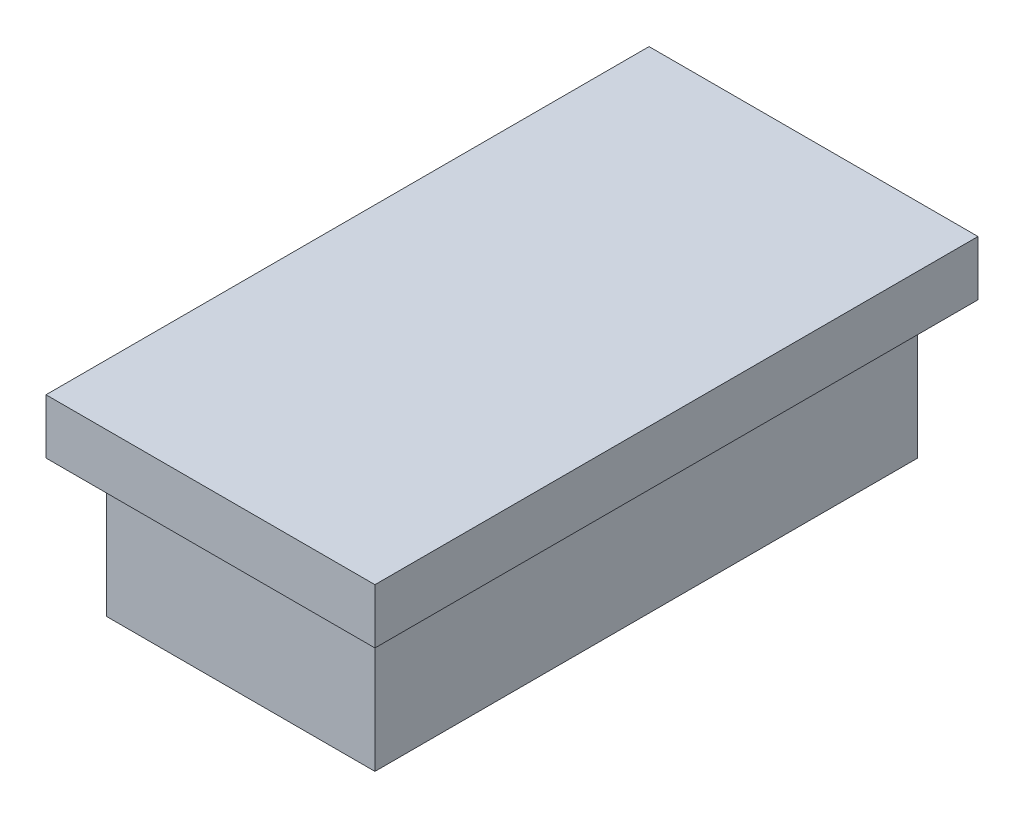
ISO-10303-21;
HEADER;
FILE_DESCRIPTION(('STEP AP214'),'2;1');
FILE_NAME('part.step','',(''),(''),'','','');
FILE_SCHEMA(('AUTOMOTIVE_DESIGN { 1 0 10303 214 1 1 1 1 }'));
ENDSEC;
DATA;
#1=APPLICATION_CONTEXT('core data for automotive mechanical design processes');
#2=APPLICATION_PROTOCOL_DEFINITION('international standard','automotive_design',2000,#1);
#3=PRODUCT_CONTEXT('',#1,'mechanical');
#4=PRODUCT('Part','Part','',(#3));
#5=PRODUCT_RELATED_PRODUCT_CATEGORY('part','',(#4));
#6=PRODUCT_DEFINITION_FORMATION('','',#4);
#7=PRODUCT_DEFINITION_CONTEXT('part definition',#1,'design');
#8=PRODUCT_DEFINITION('design','',#6,#7);
#9=PRODUCT_DEFINITION_SHAPE('','',#8);
#10=(LENGTH_UNIT() NAMED_UNIT(*) SI_UNIT(.MILLI.,.METRE.));
#11=(NAMED_UNIT(*) PLANE_ANGLE_UNIT() SI_UNIT($,.RADIAN.));
#12=(NAMED_UNIT(*) SI_UNIT($,.STERADIAN.) SOLID_ANGLE_UNIT());
#13=UNCERTAINTY_MEASURE_WITH_UNIT(LENGTH_MEASURE(1.E-05),#10,'distance_accuracy_value','');
#14=(GEOMETRIC_REPRESENTATION_CONTEXT(3) GLOBAL_UNCERTAINTY_ASSIGNED_CONTEXT((#13)) GLOBAL_UNIT_ASSIGNED_CONTEXT((#10,
#11,#12)) REPRESENTATION_CONTEXT('',''));
#15=CARTESIAN_POINT('',(0.,0.,0.));
#16=DIRECTION('',(0.,0.,1.));
#17=DIRECTION('',(1.,0.,0.));
#18=AXIS2_PLACEMENT_3D('',#15,#16,#17);
#19=CARTESIAN_POINT('',(-4.9,5.,9.9));
#20=DIRECTION('',(1.,0.,0.));
#21=DIRECTION('',(0.,0.,-1.));
#22=AXIS2_PLACEMENT_3D('',#19,#20,#21);
#23=PLANE('',#22);
#24=DIRECTION('',(0.,0.,1.));
#25=VECTOR('',#24,1.);
#26=CARTESIAN_POINT('',(-4.9,0.,9.9));
#27=LINE('',#26,#25);
#28=CARTESIAN_POINT('',(-4.9,0.,-9.9));
#29=VERTEX_POINT('',#28);
#30=CARTESIAN_POINT('',(-4.9,0.,9.9));
#31=VERTEX_POINT('',#30);
#32=EDGE_CURVE('E132',#29,#31,#27,.T.);
#33=ORIENTED_EDGE('',*,*,#32,.T.);
#34=DIRECTION('',(0.,-1.,0.));
#35=VECTOR('',#34,1.);
#36=CARTESIAN_POINT('',(-4.9,5.,9.9));
#37=LINE('',#36,#35);
#38=CARTESIAN_POINT('',(-4.9,5.,9.9));
#39=VERTEX_POINT('',#38);
#40=EDGE_CURVE('E11',#39,#31,#37,.T.);
#41=ORIENTED_EDGE('',*,*,#40,.F.);
#42=DIRECTION('',(0.,0.,1.));
#43=VECTOR('',#42,1.);
#44=CARTESIAN_POINT('',(-4.9,5.,9.9));
#45=LINE('',#44,#43);
#46=CARTESIAN_POINT('',(-4.9,5.,-9.9));
#47=VERTEX_POINT('',#46);
#48=EDGE_CURVE('E141',#47,#39,#45,.T.);
#49=ORIENTED_EDGE('',*,*,#48,.F.);
#50=DIRECTION('',(0.,-1.,0.));
#51=VECTOR('',#50,1.);
#52=CARTESIAN_POINT('',(-4.9,5.,-9.9));
#53=LINE('',#52,#51);
#54=EDGE_CURVE('E150',#47,#29,#53,.T.);
#55=ORIENTED_EDGE('',*,*,#54,.T.);
#56=EDGE_LOOP('',(#33,#41,#49,#55));
#57=FACE_BOUND('',#56,.T.);
#58=ADVANCED_FACE('F34',(#57),#23,.F.);
#59=CARTESIAN_POINT('',(4.9,5.,9.9));
#60=DIRECTION('',(0.,0.,-1.));
#61=DIRECTION('',(-1.,0.,0.));
#62=AXIS2_PLACEMENT_3D('',#59,#60,#61);
#63=PLANE('',#62);
#64=DIRECTION('',(1.,0.,0.));
#65=VECTOR('',#64,1.);
#66=CARTESIAN_POINT('',(4.9,0.,9.9));
#67=LINE('',#66,#65);
#68=CARTESIAN_POINT('',(4.9,0.,9.9));
#69=VERTEX_POINT('',#68);
#70=EDGE_CURVE('E135',#31,#69,#67,.T.);
#71=ORIENTED_EDGE('',*,*,#70,.T.);
#72=DIRECTION('',(0.,-1.,0.));
#73=VECTOR('',#72,1.);
#74=CARTESIAN_POINT('',(4.9,5.,9.9));
#75=LINE('',#74,#73);
#76=CARTESIAN_POINT('',(4.9,5.,9.9));
#77=VERTEX_POINT('',#76);
#78=EDGE_CURVE('E42',#77,#69,#75,.T.);
#79=ORIENTED_EDGE('',*,*,#78,.F.);
#80=DIRECTION('',(1.,0.,0.));
#81=VECTOR('',#80,1.);
#82=CARTESIAN_POINT('',(4.9,5.,9.9));
#83=LINE('',#82,#81);
#84=EDGE_CURVE('E76',#39,#77,#83,.T.);
#85=ORIENTED_EDGE('',*,*,#84,.F.);
#86=ORIENTED_EDGE('',*,*,#40,.T.);
#87=EDGE_LOOP('',(#71,#79,#85,#86));
#88=FACE_BOUND('',#87,.T.);
#89=ADVANCED_FACE('F176',(#88),#63,.F.);
#90=CARTESIAN_POINT('',(4.9,5.,9.9));
#91=DIRECTION('',(-1.,0.,0.));
#92=DIRECTION('',(0.,0.,1.));
#93=AXIS2_PLACEMENT_3D('',#90,#91,#92);
#94=PLANE('',#93);
#95=DIRECTION('',(0.,0.,-1.));
#96=VECTOR('',#95,1.);
#97=CARTESIAN_POINT('',(4.9,0.,9.9));
#98=LINE('',#97,#96);
#99=CARTESIAN_POINT('',(4.9,0.,-9.9));
#100=VERTEX_POINT('',#99);
#101=EDGE_CURVE('E66',#69,#100,#98,.T.);
#102=ORIENTED_EDGE('',*,*,#101,.T.);
#103=DIRECTION('',(0.,-1.,0.));
#104=VECTOR('',#103,1.);
#105=CARTESIAN_POINT('',(4.9,5.,-9.9));
#106=LINE('',#105,#104);
#107=CARTESIAN_POINT('',(4.9,5.,-9.9));
#108=VERTEX_POINT('',#107);
#109=EDGE_CURVE('E50',#108,#100,#106,.T.);
#110=ORIENTED_EDGE('',*,*,#109,.F.);
#111=DIRECTION('',(0.,0.,-1.));
#112=VECTOR('',#111,1.);
#113=CARTESIAN_POINT('',(4.9,5.,9.9));
#114=LINE('',#113,#112);
#115=EDGE_CURVE('E145',#77,#108,#114,.T.);
#116=ORIENTED_EDGE('',*,*,#115,.F.);
#117=ORIENTED_EDGE('',*,*,#78,.T.);
#118=EDGE_LOOP('',(#102,#110,#116,#117));
#119=FACE_BOUND('',#118,.T.);
#120=ADVANCED_FACE('F156',(#119),#94,.F.);
#121=CARTESIAN_POINT('',(4.9,5.,-9.9));
#122=DIRECTION('',(0.,0.,1.));
#123=DIRECTION('',(1.,0.,0.));
#124=AXIS2_PLACEMENT_3D('',#121,#122,#123);
#125=PLANE('',#124);
#126=DIRECTION('',(-1.,0.,0.));
#127=VECTOR('',#126,1.);
#128=CARTESIAN_POINT('',(4.9,0.,-9.9));
#129=LINE('',#128,#127);
#130=EDGE_CURVE('E71',#100,#29,#129,.T.);
#131=ORIENTED_EDGE('',*,*,#130,.T.);
#132=ORIENTED_EDGE('',*,*,#54,.F.);
#133=DIRECTION('',(-1.,0.,0.));
#134=VECTOR('',#133,1.);
#135=CARTESIAN_POINT('',(4.9,5.,-9.9));
#136=LINE('',#135,#134);
#137=EDGE_CURVE('E148',#108,#47,#136,.T.);
#138=ORIENTED_EDGE('',*,*,#137,.F.);
#139=ORIENTED_EDGE('',*,*,#109,.T.);
#140=EDGE_LOOP('',(#131,#132,#138,#139));
#141=FACE_BOUND('',#140,.T.);
#142=ADVANCED_FACE('F161',(#141),#125,.F.);
#143=CARTESIAN_POINT('',(0.,0.,0.));
#144=DIRECTION('',(0.,1.,0.));
#145=DIRECTION('',(0.,0.,1.));
#146=AXIS2_PLACEMENT_3D('',#143,#144,#145);
#147=PLANE('',#146);
#148=ORIENTED_EDGE('',*,*,#32,.F.);
#149=ORIENTED_EDGE('',*,*,#130,.F.);
#150=ORIENTED_EDGE('',*,*,#101,.F.);
#151=ORIENTED_EDGE('',*,*,#70,.F.);
#152=EDGE_LOOP('',(#148,#149,#150,#151));
#153=FACE_BOUND('',#152,.T.);
#154=ADVANCED_FACE('F159',(#153),#147,.F.);
#155=CARTESIAN_POINT('',(0.,5.,0.));
#156=DIRECTION('',(0.,1.,0.));
#157=DIRECTION('',(0.,0.,1.));
#158=AXIS2_PLACEMENT_3D('',#155,#156,#157);
#159=PLANE('',#158);
#160=DIRECTION('',(0.,0.,1.));
#161=VECTOR('',#160,1.);
#162=CARTESIAN_POINT('',(-6.,5.,11.));
#163=LINE('',#162,#161);
#164=CARTESIAN_POINT('',(-6.,5.,-11.));
#165=VERTEX_POINT('',#164);
#166=CARTESIAN_POINT('',(-6.,5.,11.));
#167=VERTEX_POINT('',#166);
#168=EDGE_CURVE('E131',#165,#167,#163,.T.);
#169=ORIENTED_EDGE('',*,*,#168,.F.);
#170=DIRECTION('',(-1.,0.,0.));
#171=VECTOR('',#170,1.);
#172=CARTESIAN_POINT('',(6.,5.,-11.));
#173=LINE('',#172,#171);
#174=CARTESIAN_POINT('',(6.,5.,-11.));
#175=VERTEX_POINT('',#174);
#176=EDGE_CURVE('E127',#175,#165,#173,.T.);
#177=ORIENTED_EDGE('',*,*,#176,.F.);
#178=DIRECTION('',(0.,0.,-1.));
#179=VECTOR('',#178,1.);
#180=CARTESIAN_POINT('',(6.00000000000001,5.,11.));
#181=LINE('',#180,#179);
#182=CARTESIAN_POINT('',(6.00000000000001,5.,11.));
#183=VERTEX_POINT('',#182);
#184=EDGE_CURVE('E203',#183,#175,#181,.T.);
#185=ORIENTED_EDGE('',*,*,#184,.F.);
#186=DIRECTION('',(1.,0.,0.));
#187=VECTOR('',#186,1.);
#188=CARTESIAN_POINT('',(6.00000000000001,5.,11.));
#189=LINE('',#188,#187);
#190=EDGE_CURVE('E206',#167,#183,#189,.T.);
#191=ORIENTED_EDGE('',*,*,#190,.F.);
#192=EDGE_LOOP('',(#169,#177,#185,#191));
#193=FACE_BOUND('',#192,.T.);
#194=ORIENTED_EDGE('',*,*,#137,.T.);
#195=ORIENTED_EDGE('',*,*,#48,.T.);
#196=ORIENTED_EDGE('',*,*,#84,.T.);
#197=ORIENTED_EDGE('',*,*,#115,.T.);
#198=EDGE_LOOP('',(#194,#195,#196,#197));
#199=FACE_BOUND('',#198,.T.);
#200=ADVANCED_FACE('F163',(#193,#199),#159,.F.);
#201=CARTESIAN_POINT('',(-6.,7.,11.));
#202=DIRECTION('',(1.,0.,0.));
#203=DIRECTION('',(0.,0.,-1.));
#204=AXIS2_PLACEMENT_3D('',#201,#202,#203);
#205=PLANE('',#204);
#206=ORIENTED_EDGE('',*,*,#168,.T.);
#207=DIRECTION('',(0.,-1.,0.));
#208=VECTOR('',#207,1.);
#209=CARTESIAN_POINT('',(-6.,7.,11.));
#210=LINE('',#209,#208);
#211=CARTESIAN_POINT('',(-6.,7.,11.));
#212=VERTEX_POINT('',#211);
#213=EDGE_CURVE('E111',#212,#167,#210,.T.);
#214=ORIENTED_EDGE('',*,*,#213,.F.);
#215=DIRECTION('',(0.,0.,1.));
#216=VECTOR('',#215,1.);
#217=CARTESIAN_POINT('',(-6.,7.,11.));
#218=LINE('',#217,#216);
#219=CARTESIAN_POINT('',(-6.,7.,-11.));
#220=VERTEX_POINT('',#219);
#221=EDGE_CURVE('E118',#220,#212,#218,.T.);
#222=ORIENTED_EDGE('',*,*,#221,.F.);
#223=DIRECTION('',(0.,-1.,0.));
#224=VECTOR('',#223,1.);
#225=CARTESIAN_POINT('',(-6.,7.,-11.));
#226=LINE('',#225,#224);
#227=EDGE_CURVE('E200',#220,#165,#226,.T.);
#228=ORIENTED_EDGE('',*,*,#227,.T.);
#229=EDGE_LOOP('',(#206,#214,#222,#228));
#230=FACE_BOUND('',#229,.T.);
#231=ADVANCED_FACE('F129',(#230),#205,.F.);
#232=CARTESIAN_POINT('',(6.00000000000001,7.,11.));
#233=DIRECTION('',(0.,0.,-1.));
#234=DIRECTION('',(-1.,0.,0.));
#235=AXIS2_PLACEMENT_3D('',#232,#233,#234);
#236=PLANE('',#235);
#237=ORIENTED_EDGE('',*,*,#190,.T.);
#238=DIRECTION('',(0.,-1.,0.));
#239=VECTOR('',#238,1.);
#240=CARTESIAN_POINT('',(6.00000000000001,7.,11.));
#241=LINE('',#240,#239);
#242=CARTESIAN_POINT('',(6.00000000000001,7.,11.));
#243=VERTEX_POINT('',#242);
#244=EDGE_CURVE('E114',#243,#183,#241,.T.);
#245=ORIENTED_EDGE('',*,*,#244,.F.);
#246=DIRECTION('',(1.,0.,0.));
#247=VECTOR('',#246,1.);
#248=CARTESIAN_POINT('',(6.00000000000001,7.,11.));
#249=LINE('',#248,#247);
#250=EDGE_CURVE('E107',#212,#243,#249,.T.);
#251=ORIENTED_EDGE('',*,*,#250,.F.);
#252=ORIENTED_EDGE('',*,*,#213,.T.);
#253=EDGE_LOOP('',(#237,#245,#251,#252));
#254=FACE_BOUND('',#253,.T.);
#255=ADVANCED_FACE('F109',(#254),#236,.F.);
#256=CARTESIAN_POINT('',(6.00000000000001,7.,11.));
#257=DIRECTION('',(-1.,0.,0.));
#258=DIRECTION('',(0.,0.,1.));
#259=AXIS2_PLACEMENT_3D('',#256,#257,#258);
#260=PLANE('',#259);
#261=ORIENTED_EDGE('',*,*,#184,.T.);
#262=DIRECTION('',(0.,-1.,0.));
#263=VECTOR('',#262,1.);
#264=CARTESIAN_POINT('',(6.,7.,-11.));
#265=LINE('',#264,#263);
#266=CARTESIAN_POINT('',(6.,7.,-11.));
#267=VERTEX_POINT('',#266);
#268=EDGE_CURVE('E137',#267,#175,#265,.T.);
#269=ORIENTED_EDGE('',*,*,#268,.F.);
#270=DIRECTION('',(0.,0.,-1.));
#271=VECTOR('',#270,1.);
#272=CARTESIAN_POINT('',(6.00000000000001,7.,11.));
#273=LINE('',#272,#271);
#274=EDGE_CURVE('E117',#243,#267,#273,.T.);
#275=ORIENTED_EDGE('',*,*,#274,.F.);
#276=ORIENTED_EDGE('',*,*,#244,.T.);
#277=EDGE_LOOP('',(#261,#269,#275,#276));
#278=FACE_BOUND('',#277,.T.);
#279=ADVANCED_FACE('F189',(#278),#260,.F.);
#280=CARTESIAN_POINT('',(6.,7.,-11.));
#281=DIRECTION('',(0.,0.,1.));
#282=DIRECTION('',(1.,0.,0.));
#283=AXIS2_PLACEMENT_3D('',#280,#281,#282);
#284=PLANE('',#283);
#285=ORIENTED_EDGE('',*,*,#176,.T.);
#286=ORIENTED_EDGE('',*,*,#227,.F.);
#287=DIRECTION('',(-1.,0.,0.));
#288=VECTOR('',#287,1.);
#289=CARTESIAN_POINT('',(6.,7.,-11.));
#290=LINE('',#289,#288);
#291=EDGE_CURVE('E123',#267,#220,#290,.T.);
#292=ORIENTED_EDGE('',*,*,#291,.F.);
#293=ORIENTED_EDGE('',*,*,#268,.T.);
#294=EDGE_LOOP('',(#285,#286,#292,#293));
#295=FACE_BOUND('',#294,.T.);
#296=ADVANCED_FACE('F191',(#295),#284,.F.);
#297=CARTESIAN_POINT('',(0.,7.,0.));
#298=DIRECTION('',(0.,1.,0.));
#299=DIRECTION('',(0.,0.,1.));
#300=AXIS2_PLACEMENT_3D('',#297,#298,#299);
#301=PLANE('',#300);
#302=ORIENTED_EDGE('',*,*,#221,.T.);
#303=ORIENTED_EDGE('',*,*,#250,.T.);
#304=ORIENTED_EDGE('',*,*,#274,.T.);
#305=ORIENTED_EDGE('',*,*,#291,.T.);
#306=EDGE_LOOP('',(#302,#303,#304,#305));
#307=FACE_BOUND('',#306,.T.);
#308=ADVANCED_FACE('F121',(#307),#301,.T.);
#309=CLOSED_SHELL('',(#58,#89,#120,#142,#154,#200,#231,#255,#279,#296,#308));
#310=MANIFOLD_SOLID_BREP('B2',#309);
#311=ADVANCED_BREP_SHAPE_REPRESENTATION('',(#18,#310),#14);
#312=SHAPE_DEFINITION_REPRESENTATION(#9,#311);
ENDSEC;
END-ISO-10303-21;
